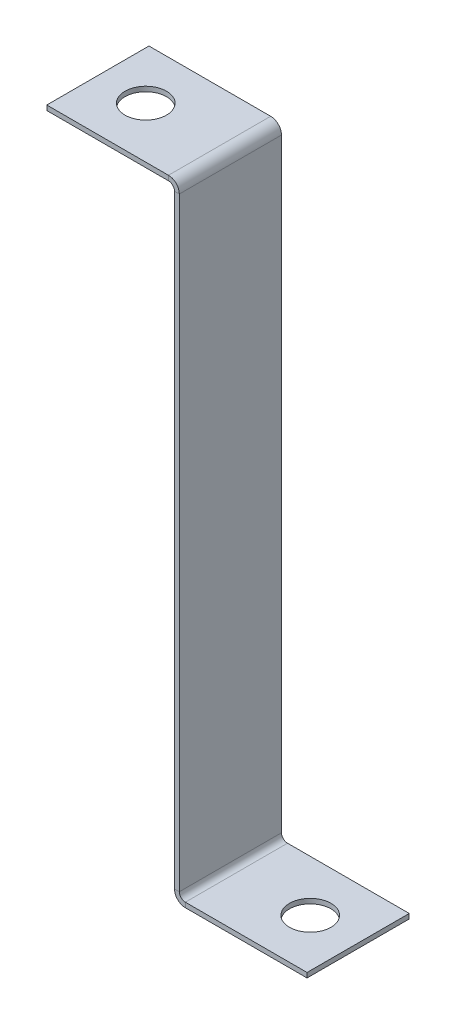
ISO-10303-21;
HEADER;
FILE_DESCRIPTION(('STEP AP214'),'2;1');
FILE_NAME('part.step','',(''),(''),'','','');
FILE_SCHEMA(('AUTOMOTIVE_DESIGN { 1 0 10303 214 1 1 1 1 }'));
ENDSEC;
DATA;
#1=APPLICATION_CONTEXT('core data for automotive mechanical design processes');
#2=APPLICATION_PROTOCOL_DEFINITION('international standard','automotive_design',2000,#1);
#3=PRODUCT_CONTEXT('',#1,'mechanical');
#4=PRODUCT('Part','Part','',(#3));
#5=PRODUCT_RELATED_PRODUCT_CATEGORY('part','',(#4));
#6=PRODUCT_DEFINITION_FORMATION('','',#4);
#7=PRODUCT_DEFINITION_CONTEXT('part definition',#1,'design');
#8=PRODUCT_DEFINITION('design','',#6,#7);
#9=PRODUCT_DEFINITION_SHAPE('','',#8);
#10=(LENGTH_UNIT() NAMED_UNIT(*) SI_UNIT(.MILLI.,.METRE.));
#11=(NAMED_UNIT(*) PLANE_ANGLE_UNIT() SI_UNIT($,.RADIAN.));
#12=(NAMED_UNIT(*) SI_UNIT($,.STERADIAN.) SOLID_ANGLE_UNIT());
#13=UNCERTAINTY_MEASURE_WITH_UNIT(LENGTH_MEASURE(1.E-05),#10,'distance_accuracy_value','');
#14=(GEOMETRIC_REPRESENTATION_CONTEXT(3) GLOBAL_UNCERTAINTY_ASSIGNED_CONTEXT((#13)) GLOBAL_UNIT_ASSIGNED_CONTEXT((#10,
#11,#12)) REPRESENTATION_CONTEXT('',''));
#15=CARTESIAN_POINT('',(0.,0.,0.));
#16=DIRECTION('',(0.,0.,1.));
#17=DIRECTION('',(1.,0.,0.));
#18=AXIS2_PLACEMENT_3D('',#15,#16,#17);
#19=CARTESIAN_POINT('',(-1.1938,0.,-25.4));
#20=DIRECTION('',(0.,0.,-1.));
#21=DIRECTION('',(-1.,0.,0.));
#22=AXIS2_PLACEMENT_3D('',#19,#20,#21);
#23=PLANE('',#22);
#24=DIRECTION('',(0.,1.,0.));
#25=VECTOR('',#24,1.);
#26=CARTESIAN_POINT('',(0.,0.,-25.4));
#27=LINE('',#26,#25);
#28=CARTESIAN_POINT('',(0.,2.69239999999999,-25.4));
#29=VERTEX_POINT('',#28);
#30=CARTESIAN_POINT('',(0.,152.8826,-25.4));
#31=VERTEX_POINT('',#30);
#32=EDGE_CURVE('E291',#29,#31,#27,.T.);
#33=ORIENTED_EDGE('',*,*,#32,.F.);
#34=DIRECTION('',(-1.,0.,0.));
#35=VECTOR('',#34,1.);
#36=CARTESIAN_POINT('',(0.,2.69239999999999,-25.4));
#37=LINE('',#36,#35);
#38=CARTESIAN_POINT('',(-1.1938,2.69239999999999,-25.4));
#39=VERTEX_POINT('',#38);
#40=EDGE_CURVE('E223',#29,#39,#37,.T.);
#41=ORIENTED_EDGE('',*,*,#40,.T.);
#42=DIRECTION('',(0.,1.,0.));
#43=VECTOR('',#42,1.);
#44=CARTESIAN_POINT('',(-1.1938,0.,-25.4));
#45=LINE('',#44,#43);
#46=CARTESIAN_POINT('',(-1.1938,152.8826,-25.4));
#47=VERTEX_POINT('',#46);
#48=EDGE_CURVE('E93',#39,#47,#45,.T.);
#49=ORIENTED_EDGE('',*,*,#48,.T.);
#50=DIRECTION('',(1.,0.,0.));
#51=VECTOR('',#50,1.);
#52=CARTESIAN_POINT('',(-1.1938,152.8826,-25.4));
#53=LINE('',#52,#51);
#54=EDGE_CURVE('E278',#47,#31,#53,.T.);
#55=ORIENTED_EDGE('',*,*,#54,.T.);
#56=EDGE_LOOP('',(#33,#41,#49,#55));
#57=FACE_BOUND('',#56,.T.);
#58=ADVANCED_FACE('F85',(#57),#23,.T.);
#59=CARTESIAN_POINT('',(-1.1938,0.,0.));
#60=DIRECTION('',(1.,0.,0.));
#61=DIRECTION('',(0.,0.,-1.));
#62=AXIS2_PLACEMENT_3D('',#59,#60,#61);
#63=PLANE('',#62);
#64=DIRECTION('',(0.,0.,-1.));
#65=VECTOR('',#64,1.);
#66=CARTESIAN_POINT('',(-1.1938,2.69239999999999,-25.4));
#67=LINE('',#66,#65);
#68=CARTESIAN_POINT('',(-1.1938,2.69239999999999,0.));
#69=VERTEX_POINT('',#68);
#70=EDGE_CURVE('E216',#39,#69,#67,.F.);
#71=ORIENTED_EDGE('',*,*,#70,.T.);
#72=DIRECTION('',(0.,-1.,0.));
#73=VECTOR('',#72,1.);
#74=CARTESIAN_POINT('',(-1.1938,0.,0.));
#75=LINE('',#74,#73);
#76=CARTESIAN_POINT('',(-1.1938,152.8826,0.));
#77=VERTEX_POINT('',#76);
#78=EDGE_CURVE('E13',#77,#69,#75,.T.);
#79=ORIENTED_EDGE('',*,*,#78,.F.);
#80=DIRECTION('',(0.,0.,-1.));
#81=VECTOR('',#80,1.);
#82=CARTESIAN_POINT('',(-1.1938,152.8826,-25.4));
#83=LINE('',#82,#81);
#84=EDGE_CURVE('E284',#47,#77,#83,.F.);
#85=ORIENTED_EDGE('',*,*,#84,.F.);
#86=ORIENTED_EDGE('',*,*,#48,.F.);
#87=EDGE_LOOP('',(#71,#79,#85,#86));
#88=FACE_BOUND('',#87,.T.);
#89=ADVANCED_FACE('F346',(#88),#63,.F.);
#90=CARTESIAN_POINT('',(0.,0.,0.));
#91=DIRECTION('',(1.,0.,0.));
#92=DIRECTION('',(0.,0.,-1.));
#93=AXIS2_PLACEMENT_3D('',#90,#91,#92);
#94=PLANE('',#93);
#95=DIRECTION('',(0.,-1.,0.));
#96=VECTOR('',#95,1.);
#97=CARTESIAN_POINT('',(0.,0.,0.));
#98=LINE('',#97,#96);
#99=CARTESIAN_POINT('',(0.,152.8826,0.));
#100=VERTEX_POINT('',#99);
#101=CARTESIAN_POINT('',(0.,2.69239999999999,0.));
#102=VERTEX_POINT('',#101);
#103=EDGE_CURVE('E294',#100,#102,#98,.T.);
#104=ORIENTED_EDGE('',*,*,#103,.T.);
#105=DIRECTION('',(0.,0.,-1.));
#106=VECTOR('',#105,1.);
#107=CARTESIAN_POINT('',(0.,2.69239999999999,-25.4));
#108=LINE('',#107,#106);
#109=EDGE_CURVE('E101',#29,#102,#108,.F.);
#110=ORIENTED_EDGE('',*,*,#109,.F.);
#111=ORIENTED_EDGE('',*,*,#32,.T.);
#112=DIRECTION('',(0.,0.,-1.));
#113=VECTOR('',#112,1.);
#114=CARTESIAN_POINT('',(0.,152.8826,-25.4));
#115=LINE('',#114,#113);
#116=EDGE_CURVE('E271',#31,#100,#115,.F.);
#117=ORIENTED_EDGE('',*,*,#116,.T.);
#118=EDGE_LOOP('',(#104,#110,#111,#117));
#119=FACE_BOUND('',#118,.T.);
#120=ADVANCED_FACE('F352',(#119),#94,.T.);
#121=CARTESIAN_POINT('',(-1.1938,0.,0.));
#122=DIRECTION('',(0.,0.,1.));
#123=DIRECTION('',(1.,0.,0.));
#124=AXIS2_PLACEMENT_3D('',#121,#122,#123);
#125=PLANE('',#124);
#126=DIRECTION('',(-1.,0.,0.));
#127=VECTOR('',#126,1.);
#128=CARTESIAN_POINT('',(0.,2.69239999999999,0.));
#129=LINE('',#128,#127);
#130=EDGE_CURVE('E108',#102,#69,#129,.T.);
#131=ORIENTED_EDGE('',*,*,#130,.F.);
#132=ORIENTED_EDGE('',*,*,#103,.F.);
#133=DIRECTION('',(1.,0.,0.));
#134=VECTOR('',#133,1.);
#135=CARTESIAN_POINT('',(-1.1938,152.8826,0.));
#136=LINE('',#135,#134);
#137=EDGE_CURVE('E288',#77,#100,#136,.T.);
#138=ORIENTED_EDGE('',*,*,#137,.F.);
#139=ORIENTED_EDGE('',*,*,#78,.T.);
#140=EDGE_LOOP('',(#131,#132,#138,#139));
#141=FACE_BOUND('',#140,.T.);
#142=ADVANCED_FACE('F423',(#141),#125,.T.);
#143=CARTESIAN_POINT('',(-2.69239999999999,152.8826,0.));
#144=DIRECTION('',(0.,0.,1.));
#145=DIRECTION('',(1.,0.,0.));
#146=AXIS2_PLACEMENT_3D('',#143,#144,#145);
#147=PLANE('',#146);
#148=DIRECTION('',(0.,-1.,0.));
#149=VECTOR('',#148,1.);
#150=CARTESIAN_POINT('',(-2.69239999999998,155.575,0.));
#151=LINE('',#150,#149);
#152=CARTESIAN_POINT('',(-2.69239999999998,154.3812,0.));
#153=VERTEX_POINT('',#152);
#154=CARTESIAN_POINT('',(-2.69239999999998,155.575,0.));
#155=VERTEX_POINT('',#154);
#156=EDGE_CURVE('E268',#153,#155,#151,.F.);
#157=ORIENTED_EDGE('',*,*,#156,.F.);
#158=CARTESIAN_POINT('',(-2.69239999999999,152.8826,0.));
#159=DIRECTION('',(0.,0.,-1.));
#160=DIRECTION('',(-1.,0.,0.));
#161=AXIS2_PLACEMENT_3D('',#158,#159,#160);
#162=CIRCLE('',#161,1.49859999999999);
#163=EDGE_CURVE('E281',#77,#153,#162,.F.);
#164=ORIENTED_EDGE('',*,*,#163,.F.);
#165=ORIENTED_EDGE('',*,*,#137,.T.);
#166=CARTESIAN_POINT('',(-2.69239999999999,152.8826,0.));
#167=DIRECTION('',(0.,0.,-1.));
#168=DIRECTION('',(-1.,0.,0.));
#169=AXIS2_PLACEMENT_3D('',#166,#167,#168);
#170=CIRCLE('',#169,2.69239999999999);
#171=EDGE_CURVE('E274',#100,#155,#170,.F.);
#172=ORIENTED_EDGE('',*,*,#171,.T.);
#173=EDGE_LOOP('',(#157,#164,#165,#172));
#174=FACE_BOUND('',#173,.T.);
#175=ADVANCED_FACE('F328',(#174),#147,.T.);
#176=CARTESIAN_POINT('',(-2.69239999999999,152.8826,-25.4));
#177=DIRECTION('',(0.,0.,1.));
#178=DIRECTION('',(1.,0.,0.));
#179=AXIS2_PLACEMENT_3D('',#176,#177,#178);
#180=PLANE('',#179);
#181=CARTESIAN_POINT('',(-2.69239999999999,152.8826,-25.4));
#182=DIRECTION('',(0.,0.,-1.));
#183=DIRECTION('',(-1.,0.,0.));
#184=AXIS2_PLACEMENT_3D('',#181,#182,#183);
#185=CIRCLE('',#184,1.49859999999999);
#186=CARTESIAN_POINT('',(-2.69239999999998,154.3812,-25.4));
#187=VERTEX_POINT('',#186);
#188=EDGE_CURVE('E243',#187,#47,#185,.T.);
#189=ORIENTED_EDGE('',*,*,#188,.F.);
#190=DIRECTION('',(0.,-1.,0.));
#191=VECTOR('',#190,1.);
#192=CARTESIAN_POINT('',(-2.69239999999998,154.3812,-25.4));
#193=LINE('',#192,#191);
#194=CARTESIAN_POINT('',(-2.69239999999998,155.575,-25.4));
#195=VERTEX_POINT('',#194);
#196=EDGE_CURVE('E263',#187,#195,#193,.F.);
#197=ORIENTED_EDGE('',*,*,#196,.T.);
#198=CARTESIAN_POINT('',(-2.69239999999999,152.8826,-25.4));
#199=DIRECTION('',(0.,0.,-1.));
#200=DIRECTION('',(-1.,0.,0.));
#201=AXIS2_PLACEMENT_3D('',#198,#199,#200);
#202=CIRCLE('',#201,2.69239999999999);
#203=EDGE_CURVE('E275',#195,#31,#202,.T.);
#204=ORIENTED_EDGE('',*,*,#203,.T.);
#205=ORIENTED_EDGE('',*,*,#54,.F.);
#206=EDGE_LOOP('',(#189,#197,#204,#205));
#207=FACE_BOUND('',#206,.T.);
#208=ADVANCED_FACE('F417',(#207),#180,.F.);
#209=CARTESIAN_POINT('',(-2.69239999999999,152.8826,-25.4));
#210=DIRECTION('',(0.,0.,-1.));
#211=DIRECTION('',(0.,1.,0.));
#212=AXIS2_PLACEMENT_3D('',#209,#210,#211);
#213=CYLINDRICAL_SURFACE('',#212,2.69239999999999);
#214=ORIENTED_EDGE('',*,*,#116,.F.);
#215=ORIENTED_EDGE('',*,*,#203,.F.);
#216=DIRECTION('',(0.,0.,-1.));
#217=VECTOR('',#216,1.);
#218=CARTESIAN_POINT('',(-2.69239999999998,155.575,0.));
#219=LINE('',#218,#217);
#220=EDGE_CURVE('E261',#195,#155,#219,.F.);
#221=ORIENTED_EDGE('',*,*,#220,.T.);
#222=ORIENTED_EDGE('',*,*,#171,.F.);
#223=EDGE_LOOP('',(#214,#215,#221,#222));
#224=FACE_BOUND('',#223,.T.);
#225=ADVANCED_FACE('F326',(#224),#213,.T.);
#226=CARTESIAN_POINT('',(-2.69239999999999,152.8826,-25.4));
#227=DIRECTION('',(0.,0.,-1.));
#228=DIRECTION('',(0.,1.,0.));
#229=AXIS2_PLACEMENT_3D('',#226,#227,#228);
#230=CYLINDRICAL_SURFACE('',#229,1.49859999999999);
#231=ORIENTED_EDGE('',*,*,#84,.T.);
#232=ORIENTED_EDGE('',*,*,#163,.T.);
#233=DIRECTION('',(0.,0.,-1.));
#234=VECTOR('',#233,1.);
#235=CARTESIAN_POINT('',(-2.69239999999998,154.3812,0.));
#236=LINE('',#235,#234);
#237=EDGE_CURVE('E266',#153,#187,#236,.T.);
#238=ORIENTED_EDGE('',*,*,#237,.T.);
#239=ORIENTED_EDGE('',*,*,#188,.T.);
#240=EDGE_LOOP('',(#231,#232,#238,#239));
#241=FACE_BOUND('',#240,.T.);
#242=ADVANCED_FACE('F342',(#241),#230,.F.);
#243=CARTESIAN_POINT('',(-32.9438,155.575,-25.4));
#244=DIRECTION('',(0.,0.,1.));
#245=DIRECTION('',(1.,0.,0.));
#246=AXIS2_PLACEMENT_3D('',#243,#244,#245);
#247=PLANE('',#246);
#248=ORIENTED_EDGE('',*,*,#196,.F.);
#249=DIRECTION('',(1.,0.,0.));
#250=VECTOR('',#249,1.);
#251=CARTESIAN_POINT('',(-32.9438,154.3812,-25.4));
#252=LINE('',#251,#250);
#253=CARTESIAN_POINT('',(-32.9438,154.3812,-25.4));
#254=VERTEX_POINT('',#253);
#255=EDGE_CURVE('E259',#187,#254,#252,.F.);
#256=ORIENTED_EDGE('',*,*,#255,.T.);
#257=DIRECTION('',(0.,-1.,0.));
#258=VECTOR('',#257,1.);
#259=CARTESIAN_POINT('',(-32.9438,155.575,-25.4));
#260=LINE('',#259,#258);
#261=CARTESIAN_POINT('',(-32.9438,155.575,-25.4));
#262=VERTEX_POINT('',#261);
#263=EDGE_CURVE('E240',#262,#254,#260,.T.);
#264=ORIENTED_EDGE('',*,*,#263,.F.);
#265=DIRECTION('',(-1.,0.,0.));
#266=VECTOR('',#265,1.);
#267=CARTESIAN_POINT('',(5.48177412488638E-13,155.575,-25.4));
#268=LINE('',#267,#266);
#269=EDGE_CURVE('E252',#195,#262,#268,.T.);
#270=ORIENTED_EDGE('',*,*,#269,.F.);
#271=EDGE_LOOP('',(#248,#256,#264,#270));
#272=FACE_BOUND('',#271,.T.);
#273=ADVANCED_FACE('F316',(#272),#247,.F.);
#274=CARTESIAN_POINT('',(-1.1938,155.575,0.));
#275=DIRECTION('',(0.,0.,-1.));
#276=DIRECTION('',(-1.,0.,0.));
#277=AXIS2_PLACEMENT_3D('',#274,#275,#276);
#278=PLANE('',#277);
#279=ORIENTED_EDGE('',*,*,#156,.T.);
#280=DIRECTION('',(1.,0.,0.));
#281=VECTOR('',#280,1.);
#282=CARTESIAN_POINT('',(5.48177412488638E-13,155.575,0.));
#283=LINE('',#282,#281);
#284=CARTESIAN_POINT('',(-32.9438,155.575,0.));
#285=VERTEX_POINT('',#284);
#286=EDGE_CURVE('E247',#285,#155,#283,.T.);
#287=ORIENTED_EDGE('',*,*,#286,.F.);
#288=DIRECTION('',(0.,-1.,0.));
#289=VECTOR('',#288,1.);
#290=CARTESIAN_POINT('',(-32.9438,155.575,0.));
#291=LINE('',#290,#289);
#292=CARTESIAN_POINT('',(-32.9438,154.3812,0.));
#293=VERTEX_POINT('',#292);
#294=EDGE_CURVE('E244',#285,#293,#291,.T.);
#295=ORIENTED_EDGE('',*,*,#294,.T.);
#296=DIRECTION('',(-1.,0.,0.));
#297=VECTOR('',#296,1.);
#298=CARTESIAN_POINT('',(-1.1938,154.3812,0.));
#299=LINE('',#298,#297);
#300=EDGE_CURVE('E254',#293,#153,#299,.F.);
#301=ORIENTED_EDGE('',*,*,#300,.T.);
#302=EDGE_LOOP('',(#279,#287,#295,#301));
#303=FACE_BOUND('',#302,.T.);
#304=ADVANCED_FACE('F332',(#303),#278,.F.);
#305=CARTESIAN_POINT('',(5.48177412488638E-13,155.575,0.));
#306=DIRECTION('',(0.,-1.,0.));
#307=DIRECTION('',(1.,0.,0.));
#308=AXIS2_PLACEMENT_3D('',#305,#306,#307);
#309=PLANE('',#308);
#310=CARTESIAN_POINT('',(-21.03755,155.575,-12.7));
#311=DIRECTION('',(0.,1.,0.));
#312=DIRECTION('',(-1.,0.,0.));
#313=AXIS2_PLACEMENT_3D('',#310,#311,#312);
#314=CIRCLE('',#313,5.159375);
#315=CARTESIAN_POINT('',(-26.196925,155.575,-12.7));
#316=VERTEX_POINT('',#315);
#317=EDGE_CURVE('E234',#316,#316,#314,.T.);
#318=ORIENTED_EDGE('',*,*,#317,.F.);
#319=EDGE_LOOP('',(#318));
#320=FACE_BOUND('',#319,.T.);
#321=ORIENTED_EDGE('',*,*,#220,.F.);
#322=ORIENTED_EDGE('',*,*,#269,.T.);
#323=DIRECTION('',(0.,0.,1.));
#324=VECTOR('',#323,1.);
#325=CARTESIAN_POINT('',(-32.9438,155.575,0.));
#326=LINE('',#325,#324);
#327=EDGE_CURVE('E250',#262,#285,#326,.T.);
#328=ORIENTED_EDGE('',*,*,#327,.T.);
#329=ORIENTED_EDGE('',*,*,#286,.T.);
#330=EDGE_LOOP('',(#321,#322,#328,#329));
#331=FACE_BOUND('',#330,.T.);
#332=ADVANCED_FACE('F307',(#320,#331),#309,.F.);
#333=CARTESIAN_POINT('',(5.44009282066327E-13,154.3812,0.));
#334=DIRECTION('',(0.,-1.,0.));
#335=DIRECTION('',(1.,0.,0.));
#336=AXIS2_PLACEMENT_3D('',#333,#334,#335);
#337=PLANE('',#336);
#338=CARTESIAN_POINT('',(-21.03755,154.3812,-12.7));
#339=DIRECTION('',(0.,-1.,0.));
#340=DIRECTION('',(1.,0.,0.));
#341=AXIS2_PLACEMENT_3D('',#338,#339,#340);
#342=CIRCLE('',#341,5.159375);
#343=CARTESIAN_POINT('',(-15.878175,154.3812,-12.7));
#344=VERTEX_POINT('',#343);
#345=EDGE_CURVE('E239',#344,#344,#342,.T.);
#346=ORIENTED_EDGE('',*,*,#345,.F.);
#347=EDGE_LOOP('',(#346));
#348=FACE_BOUND('',#347,.T.);
#349=ORIENTED_EDGE('',*,*,#255,.F.);
#350=ORIENTED_EDGE('',*,*,#237,.F.);
#351=ORIENTED_EDGE('',*,*,#300,.F.);
#352=DIRECTION('',(0.,0.,-1.));
#353=VECTOR('',#352,1.);
#354=CARTESIAN_POINT('',(-32.9438,154.3812,0.));
#355=LINE('',#354,#353);
#356=EDGE_CURVE('E257',#254,#293,#355,.F.);
#357=ORIENTED_EDGE('',*,*,#356,.F.);
#358=EDGE_LOOP('',(#349,#350,#351,#357));
#359=FACE_BOUND('',#358,.T.);
#360=ADVANCED_FACE('F303',(#348,#359),#337,.T.);
#361=CARTESIAN_POINT('',(-32.9438,155.575,0.));
#362=DIRECTION('',(1.,0.,0.));
#363=DIRECTION('',(0.,1.,0.));
#364=AXIS2_PLACEMENT_3D('',#361,#362,#363);
#365=PLANE('',#364);
#366=ORIENTED_EDGE('',*,*,#356,.T.);
#367=ORIENTED_EDGE('',*,*,#294,.F.);
#368=ORIENTED_EDGE('',*,*,#327,.F.);
#369=ORIENTED_EDGE('',*,*,#263,.T.);
#370=EDGE_LOOP('',(#366,#367,#368,#369));
#371=FACE_BOUND('',#370,.T.);
#372=ADVANCED_FACE('F306',(#371),#365,.F.);
#373=CARTESIAN_POINT('',(-21.0375500000006,0.,-12.7));
#374=DIRECTION('',(0.,1.,0.));
#375=DIRECTION('',(-1.,0.,0.));
#376=AXIS2_PLACEMENT_3D('',#373,#374,#375);
#377=CYLINDRICAL_SURFACE('',#376,5.159375);
#378=ORIENTED_EDGE('',*,*,#345,.T.);
#379=EDGE_LOOP('',(#378));
#380=FACE_BOUND('',#379,.T.);
#381=ORIENTED_EDGE('',*,*,#317,.T.);
#382=EDGE_LOOP('',(#381));
#383=FACE_BOUND('',#382,.T.);
#384=ADVANCED_FACE('F300',(#380,#383),#377,.F.);
#385=CARTESIAN_POINT('',(1.4986,2.69239999999999,0.));
#386=DIRECTION('',(0.,0.,1.));
#387=DIRECTION('',(1.,0.,0.));
#388=AXIS2_PLACEMENT_3D('',#385,#386,#387);
#389=PLANE('',#388);
#390=DIRECTION('',(0.,1.,0.));
#391=VECTOR('',#390,1.);
#392=CARTESIAN_POINT('',(1.49859999999999,0.,0.));
#393=LINE('',#392,#391);
#394=CARTESIAN_POINT('',(1.49859999999999,1.19379999999999,0.));
#395=VERTEX_POINT('',#394);
#396=CARTESIAN_POINT('',(1.49859999999999,0.,0.));
#397=VERTEX_POINT('',#396);
#398=EDGE_CURVE('E199',#395,#397,#393,.F.);
#399=ORIENTED_EDGE('',*,*,#398,.F.);
#400=CARTESIAN_POINT('',(1.4986,2.69239999999999,0.));
#401=DIRECTION('',(0.,0.,-1.));
#402=DIRECTION('',(-1.,0.,0.));
#403=AXIS2_PLACEMENT_3D('',#400,#401,#402);
#404=CIRCLE('',#403,1.4986);
#405=EDGE_CURVE('E226',#102,#395,#404,.F.);
#406=ORIENTED_EDGE('',*,*,#405,.F.);
#407=ORIENTED_EDGE('',*,*,#130,.T.);
#408=CARTESIAN_POINT('',(1.4986,2.69239999999999,0.));
#409=DIRECTION('',(0.,0.,-1.));
#410=DIRECTION('',(-1.,0.,0.));
#411=AXIS2_PLACEMENT_3D('',#408,#409,#410);
#412=CIRCLE('',#411,2.6924);
#413=EDGE_CURVE('E219',#69,#397,#412,.F.);
#414=ORIENTED_EDGE('',*,*,#413,.T.);
#415=EDGE_LOOP('',(#399,#406,#407,#414));
#416=FACE_BOUND('',#415,.T.);
#417=ADVANCED_FACE('F404',(#416),#389,.T.);
#418=CARTESIAN_POINT('',(1.4986,2.69239999999999,-25.4));
#419=DIRECTION('',(0.,0.,1.));
#420=DIRECTION('',(1.,0.,0.));
#421=AXIS2_PLACEMENT_3D('',#418,#419,#420);
#422=PLANE('',#421);
#423=CARTESIAN_POINT('',(1.4986,2.69239999999999,-25.4));
#424=DIRECTION('',(0.,0.,-1.));
#425=DIRECTION('',(-1.,0.,0.));
#426=AXIS2_PLACEMENT_3D('',#423,#424,#425);
#427=CIRCLE('',#426,1.4986);
#428=CARTESIAN_POINT('',(1.49859999999999,1.19379999999999,-25.4));
#429=VERTEX_POINT('',#428);
#430=EDGE_CURVE('E230',#429,#29,#427,.T.);
#431=ORIENTED_EDGE('',*,*,#430,.F.);
#432=DIRECTION('',(0.,1.,0.));
#433=VECTOR('',#432,1.);
#434=CARTESIAN_POINT('',(1.49859999999999,1.19379999999999,-25.4));
#435=LINE('',#434,#433);
#436=CARTESIAN_POINT('',(1.49859999999999,0.,-25.4));
#437=VERTEX_POINT('',#436);
#438=EDGE_CURVE('E210',#429,#437,#435,.F.);
#439=ORIENTED_EDGE('',*,*,#438,.T.);
#440=CARTESIAN_POINT('',(1.4986,2.69239999999999,-25.4));
#441=DIRECTION('',(0.,0.,-1.));
#442=DIRECTION('',(-1.,0.,0.));
#443=AXIS2_PLACEMENT_3D('',#440,#441,#442);
#444=CIRCLE('',#443,2.6924);
#445=EDGE_CURVE('E220',#437,#39,#444,.T.);
#446=ORIENTED_EDGE('',*,*,#445,.T.);
#447=ORIENTED_EDGE('',*,*,#40,.F.);
#448=EDGE_LOOP('',(#431,#439,#446,#447));
#449=FACE_BOUND('',#448,.T.);
#450=ADVANCED_FACE('F360',(#449),#422,.F.);
#451=CARTESIAN_POINT('',(1.4986,2.69239999999999,-25.4));
#452=DIRECTION('',(0.,0.,-1.));
#453=DIRECTION('',(0.,-1.,0.));
#454=AXIS2_PLACEMENT_3D('',#451,#452,#453);
#455=CYLINDRICAL_SURFACE('',#454,2.6924);
#456=ORIENTED_EDGE('',*,*,#70,.F.);
#457=ORIENTED_EDGE('',*,*,#445,.F.);
#458=DIRECTION('',(0.,0.,-1.));
#459=VECTOR('',#458,1.);
#460=CARTESIAN_POINT('',(1.49859999999999,0.,0.));
#461=LINE('',#460,#459);
#462=EDGE_CURVE('E208',#437,#397,#461,.F.);
#463=ORIENTED_EDGE('',*,*,#462,.T.);
#464=ORIENTED_EDGE('',*,*,#413,.F.);
#465=EDGE_LOOP('',(#456,#457,#463,#464));
#466=FACE_BOUND('',#465,.T.);
#467=ADVANCED_FACE('F398',(#466),#455,.T.);
#468=CARTESIAN_POINT('',(1.4986,2.69239999999999,-25.4));
#469=DIRECTION('',(0.,0.,-1.));
#470=DIRECTION('',(0.,-1.,0.));
#471=AXIS2_PLACEMENT_3D('',#468,#469,#470);
#472=CYLINDRICAL_SURFACE('',#471,1.4986);
#473=ORIENTED_EDGE('',*,*,#109,.T.);
#474=ORIENTED_EDGE('',*,*,#405,.T.);
#475=DIRECTION('',(0.,0.,-1.));
#476=VECTOR('',#475,1.);
#477=CARTESIAN_POINT('',(1.49859999999999,1.19379999999999,0.));
#478=LINE('',#477,#476);
#479=EDGE_CURVE('E213',#395,#429,#478,.T.);
#480=ORIENTED_EDGE('',*,*,#479,.T.);
#481=ORIENTED_EDGE('',*,*,#430,.T.);
#482=EDGE_LOOP('',(#473,#474,#480,#481));
#483=FACE_BOUND('',#482,.T.);
#484=ADVANCED_FACE('F363',(#483),#472,.F.);
#485=CARTESIAN_POINT('',(0.,0.,0.));
#486=DIRECTION('',(0.,0.,-1.));
#487=DIRECTION('',(-1.,0.,0.));
#488=AXIS2_PLACEMENT_3D('',#485,#486,#487);
#489=PLANE('',#488);
#490=ORIENTED_EDGE('',*,*,#398,.T.);
#491=DIRECTION('',(-1.,0.,0.));
#492=VECTOR('',#491,1.);
#493=CARTESIAN_POINT('',(0.,0.,0.));
#494=LINE('',#493,#492);
#495=CARTESIAN_POINT('',(31.75,-1.10854532508269E-13,0.));
#496=VERTEX_POINT('',#495);
#497=EDGE_CURVE('E180',#496,#397,#494,.T.);
#498=ORIENTED_EDGE('',*,*,#497,.F.);
#499=DIRECTION('',(0.,1.,0.));
#500=VECTOR('',#499,1.);
#501=CARTESIAN_POINT('',(31.75,-1.10854532508269E-13,0.));
#502=LINE('',#501,#500);
#503=CARTESIAN_POINT('',(31.75,1.19379999999989,0.));
#504=VERTEX_POINT('',#503);
#505=EDGE_CURVE('E186',#496,#504,#502,.T.);
#506=ORIENTED_EDGE('',*,*,#505,.T.);
#507=DIRECTION('',(1.,0.,0.));
#508=VECTOR('',#507,1.);
#509=CARTESIAN_POINT('',(0.,1.1938,0.));
#510=LINE('',#509,#508);
#511=EDGE_CURVE('E206',#504,#395,#510,.F.);
#512=ORIENTED_EDGE('',*,*,#511,.T.);
#513=EDGE_LOOP('',(#490,#498,#506,#512));
#514=FACE_BOUND('',#513,.T.);
#515=ADVANCED_FACE('F198',(#514),#489,.F.);
#516=CARTESIAN_POINT('',(31.75,-1.10805462028019E-13,-25.4));
#517=DIRECTION('',(0.,0.,1.));
#518=DIRECTION('',(1.,0.,0.));
#519=AXIS2_PLACEMENT_3D('',#516,#517,#518);
#520=PLANE('',#519);
#521=ORIENTED_EDGE('',*,*,#438,.F.);
#522=DIRECTION('',(-1.,0.,0.));
#523=VECTOR('',#522,1.);
#524=CARTESIAN_POINT('',(31.75,1.19379999999989,-25.4));
#525=LINE('',#524,#523);
#526=CARTESIAN_POINT('',(31.75,1.19379999999989,-25.4));
#527=VERTEX_POINT('',#526);
#528=EDGE_CURVE('E202',#429,#527,#525,.F.);
#529=ORIENTED_EDGE('',*,*,#528,.T.);
#530=DIRECTION('',(0.,1.,0.));
#531=VECTOR('',#530,1.);
#532=CARTESIAN_POINT('',(31.75,-1.10805462028019E-13,-25.4));
#533=LINE('',#532,#531);
#534=CARTESIAN_POINT('',(31.75,-1.10854532508269E-13,-25.4));
#535=VERTEX_POINT('',#534);
#536=EDGE_CURVE('E195',#535,#527,#533,.T.);
#537=ORIENTED_EDGE('',*,*,#536,.F.);
#538=DIRECTION('',(1.,0.,0.));
#539=VECTOR('',#538,1.);
#540=CARTESIAN_POINT('',(0.,0.,-25.4));
#541=LINE('',#540,#539);
#542=EDGE_CURVE('E182',#437,#535,#541,.T.);
#543=ORIENTED_EDGE('',*,*,#542,.F.);
#544=EDGE_LOOP('',(#521,#529,#537,#543));
#545=FACE_BOUND('',#544,.T.);
#546=ADVANCED_FACE('F370',(#545),#520,.F.);
#547=CARTESIAN_POINT('',(0.,0.,0.));
#548=DIRECTION('',(0.,1.,0.));
#549=DIRECTION('',(-1.,0.,0.));
#550=AXIS2_PLACEMENT_3D('',#547,#548,#549);
#551=PLANE('',#550);
#552=CARTESIAN_POINT('',(19.84375,0.,-12.7));
#553=DIRECTION('',(0.,-1.,0.));
#554=DIRECTION('',(1.,0.,0.));
#555=AXIS2_PLACEMENT_3D('',#552,#553,#554);
#556=CIRCLE('',#555,5.159375);
#557=CARTESIAN_POINT('',(25.003125,0.,-12.7));
#558=VERTEX_POINT('',#557);
#559=EDGE_CURVE('E373',#558,#558,#556,.T.);
#560=ORIENTED_EDGE('',*,*,#559,.F.);
#561=EDGE_LOOP('',(#560));
#562=FACE_BOUND('',#561,.T.);
#563=ORIENTED_EDGE('',*,*,#462,.F.);
#564=ORIENTED_EDGE('',*,*,#542,.T.);
#565=DIRECTION('',(0.,0.,1.));
#566=VECTOR('',#565,1.);
#567=CARTESIAN_POINT('',(31.75,-1.10854532508269E-13,0.));
#568=LINE('',#567,#566);
#569=EDGE_CURVE('E175',#535,#496,#568,.T.);
#570=ORIENTED_EDGE('',*,*,#569,.T.);
#571=ORIENTED_EDGE('',*,*,#497,.T.);
#572=EDGE_LOOP('',(#563,#564,#570,#571));
#573=FACE_BOUND('',#572,.T.);
#574=ADVANCED_FACE('F178',(#562,#573),#551,.F.);
#575=CARTESIAN_POINT('',(0.,1.1938,0.));
#576=DIRECTION('',(0.,1.,0.));
#577=DIRECTION('',(-1.,0.,0.));
#578=AXIS2_PLACEMENT_3D('',#575,#576,#577);
#579=PLANE('',#578);
#580=CARTESIAN_POINT('',(19.84375,1.19379999999994,-12.7));
#581=DIRECTION('',(0.,1.,0.));
#582=DIRECTION('',(-1.,0.,0.));
#583=AXIS2_PLACEMENT_3D('',#580,#581,#582);
#584=CIRCLE('',#583,5.159375);
#585=CARTESIAN_POINT('',(14.684375,1.19379999999996,-12.7));
#586=VERTEX_POINT('',#585);
#587=EDGE_CURVE('E88',#586,#586,#584,.T.);
#588=ORIENTED_EDGE('',*,*,#587,.F.);
#589=EDGE_LOOP('',(#588));
#590=FACE_BOUND('',#589,.T.);
#591=ORIENTED_EDGE('',*,*,#528,.F.);
#592=ORIENTED_EDGE('',*,*,#479,.F.);
#593=ORIENTED_EDGE('',*,*,#511,.F.);
#594=DIRECTION('',(0.,0.,-1.));
#595=VECTOR('',#594,1.);
#596=CARTESIAN_POINT('',(31.75,1.19379999999989,0.));
#597=LINE('',#596,#595);
#598=EDGE_CURVE('E191',#527,#504,#597,.F.);
#599=ORIENTED_EDGE('',*,*,#598,.F.);
#600=EDGE_LOOP('',(#591,#592,#593,#599));
#601=FACE_BOUND('',#600,.T.);
#602=ADVANCED_FACE('F368',(#590,#601),#579,.T.);
#603=CARTESIAN_POINT('',(31.75,-1.10805462028019E-13,0.));
#604=DIRECTION('',(-1.,0.,0.));
#605=DIRECTION('',(0.,-1.,0.));
#606=AXIS2_PLACEMENT_3D('',#603,#604,#605);
#607=PLANE('',#606);
#608=ORIENTED_EDGE('',*,*,#598,.T.);
#609=ORIENTED_EDGE('',*,*,#505,.F.);
#610=ORIENTED_EDGE('',*,*,#569,.F.);
#611=ORIENTED_EDGE('',*,*,#536,.T.);
#612=EDGE_LOOP('',(#608,#609,#610,#611));
#613=FACE_BOUND('',#612,.T.);
#614=ADVANCED_FACE('F189',(#613),#607,.F.);
#615=CARTESIAN_POINT('',(19.8437500000005,155.575,-12.7));
#616=DIRECTION('',(0.,-1.,0.));
#617=DIRECTION('',(1.,0.,0.));
#618=AXIS2_PLACEMENT_3D('',#615,#616,#617);
#619=CYLINDRICAL_SURFACE('',#618,5.159375);
#620=ORIENTED_EDGE('',*,*,#587,.T.);
#621=EDGE_LOOP('',(#620));
#622=FACE_BOUND('',#621,.T.);
#623=ORIENTED_EDGE('',*,*,#559,.T.);
#624=EDGE_LOOP('',(#623));
#625=FACE_BOUND('',#624,.T.);
#626=ADVANCED_FACE('F380',(#622,#625),#619,.F.);
#627=CLOSED_SHELL('',(#58,#89,#120,#142,#175,#208,#225,#242,#273,#304,#332,#360,#372,#384,#417,
#450,#467,#484,#515,#546,#574,#602,#614,#626));
#628=MANIFOLD_SOLID_BREP('B2',#627);
#629=ADVANCED_BREP_SHAPE_REPRESENTATION('',(#18,#628),#14);
#630=SHAPE_DEFINITION_REPRESENTATION(#9,#629);
ENDSEC;
END-ISO-10303-21;
